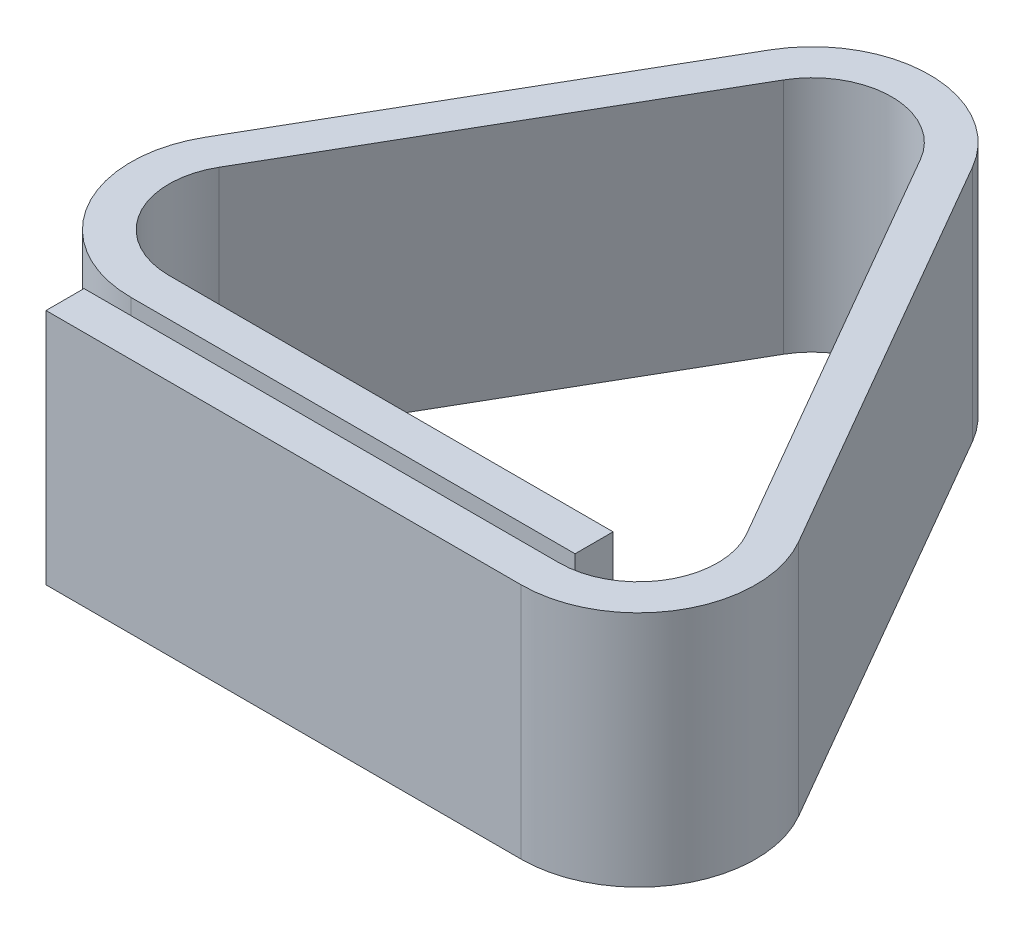
ISO-10303-21;
HEADER;
FILE_DESCRIPTION(('STEP AP214'),'2;1');
FILE_NAME('part.step','',(''),(''),'','','');
FILE_SCHEMA(('AUTOMOTIVE_DESIGN { 1 0 10303 214 1 1 1 1 }'));
ENDSEC;
DATA;
#1=APPLICATION_CONTEXT('core data for automotive mechanical design processes');
#2=APPLICATION_PROTOCOL_DEFINITION('international standard','automotive_design',2000,#1);
#3=PRODUCT_CONTEXT('',#1,'mechanical');
#4=PRODUCT('Part','Part','',(#3));
#5=PRODUCT_RELATED_PRODUCT_CATEGORY('part','',(#4));
#6=PRODUCT_DEFINITION_FORMATION('','',#4);
#7=PRODUCT_DEFINITION_CONTEXT('part definition',#1,'design');
#8=PRODUCT_DEFINITION('design','',#6,#7);
#9=PRODUCT_DEFINITION_SHAPE('','',#8);
#10=(LENGTH_UNIT() NAMED_UNIT(*) SI_UNIT(.MILLI.,.METRE.));
#11=(NAMED_UNIT(*) PLANE_ANGLE_UNIT() SI_UNIT($,.RADIAN.));
#12=(NAMED_UNIT(*) SI_UNIT($,.STERADIAN.) SOLID_ANGLE_UNIT());
#13=UNCERTAINTY_MEASURE_WITH_UNIT(LENGTH_MEASURE(1.E-05),#10,'distance_accuracy_value','');
#14=(GEOMETRIC_REPRESENTATION_CONTEXT(3) GLOBAL_UNCERTAINTY_ASSIGNED_CONTEXT((#13)) GLOBAL_UNIT_ASSIGNED_CONTEXT((#10,
#11,#12)) REPRESENTATION_CONTEXT('',''));
#15=CARTESIAN_POINT('',(0.,0.,0.));
#16=DIRECTION('',(0.,0.,1.));
#17=DIRECTION('',(1.,0.,0.));
#18=AXIS2_PLACEMENT_3D('',#15,#16,#17);
#19=CARTESIAN_POINT('',(0.,15.,0.));
#20=DIRECTION('',(1.,0.,0.));
#21=DIRECTION('',(0.,0.,-1.));
#22=AXIS2_PLACEMENT_3D('',#19,#20,#21);
#23=PLANE('',#22);
#24=DIRECTION('',(0.,0.,1.));
#25=VECTOR('',#24,1.);
#26=CARTESIAN_POINT('',(0.,0.,0.));
#27=LINE('',#26,#25);
#28=CARTESIAN_POINT('',(0.,0.,0.));
#29=VERTEX_POINT('',#28);
#30=CARTESIAN_POINT('',(0.,0.,2.4));
#31=VERTEX_POINT('',#30);
#32=EDGE_CURVE('E177',#29,#31,#27,.T.);
#33=ORIENTED_EDGE('',*,*,#32,.T.);
#34=DIRECTION('',(0.,-1.,0.));
#35=VECTOR('',#34,1.);
#36=CARTESIAN_POINT('',(0.,15.,2.4));
#37=LINE('',#36,#35);
#38=CARTESIAN_POINT('',(0.,15.,2.4));
#39=VERTEX_POINT('',#38);
#40=EDGE_CURVE('E11',#39,#31,#37,.T.);
#41=ORIENTED_EDGE('',*,*,#40,.F.);
#42=DIRECTION('',(0.,0.,1.));
#43=VECTOR('',#42,1.);
#44=CARTESIAN_POINT('',(0.,15.,0.));
#45=LINE('',#44,#43);
#46=CARTESIAN_POINT('',(0.,15.,0.));
#47=VERTEX_POINT('',#46);
#48=EDGE_CURVE('E207',#47,#39,#45,.T.);
#49=ORIENTED_EDGE('',*,*,#48,.F.);
#50=DIRECTION('',(0.,-1.,0.));
#51=VECTOR('',#50,1.);
#52=CARTESIAN_POINT('',(0.,15.,0.));
#53=LINE('',#52,#51);
#54=EDGE_CURVE('E173',#47,#29,#53,.T.);
#55=ORIENTED_EDGE('',*,*,#54,.T.);
#56=EDGE_LOOP('',(#33,#41,#49,#55));
#57=FACE_BOUND('',#56,.T.);
#58=ADVANCED_FACE('F33',(#57),#23,.F.);
#59=CARTESIAN_POINT('',(0.,15.,2.4));
#60=DIRECTION('',(0.,0.,-1.));
#61=DIRECTION('',(-1.,0.,0.));
#62=AXIS2_PLACEMENT_3D('',#59,#60,#61);
#63=PLANE('',#62);
#64=DIRECTION('',(1.,0.,0.));
#65=VECTOR('',#64,1.);
#66=CARTESIAN_POINT('',(0.,0.,2.4));
#67=LINE('',#66,#65);
#68=CARTESIAN_POINT('',(30.,0.,2.4));
#69=VERTEX_POINT('',#68);
#70=EDGE_CURVE('E180',#31,#69,#67,.T.);
#71=ORIENTED_EDGE('',*,*,#70,.T.);
#72=DIRECTION('',(0.,-1.,0.));
#73=VECTOR('',#72,1.);
#74=CARTESIAN_POINT('',(30.,15.,2.4));
#75=LINE('',#74,#73);
#76=CARTESIAN_POINT('',(30.,15.,2.4));
#77=VERTEX_POINT('',#76);
#78=EDGE_CURVE('E41',#77,#69,#75,.T.);
#79=ORIENTED_EDGE('',*,*,#78,.F.);
#80=DIRECTION('',(1.,0.,0.));
#81=VECTOR('',#80,1.);
#82=CARTESIAN_POINT('',(0.,15.,2.4));
#83=LINE('',#82,#81);
#84=EDGE_CURVE('E116',#39,#77,#83,.T.);
#85=ORIENTED_EDGE('',*,*,#84,.F.);
#86=ORIENTED_EDGE('',*,*,#40,.T.);
#87=EDGE_LOOP('',(#71,#79,#85,#86));
#88=FACE_BOUND('',#87,.T.);
#89=ADVANCED_FACE('F305',(#88),#63,.F.);
#90=CARTESIAN_POINT('',(30.,15.,-5.));
#91=DIRECTION('',(0.,-1.,0.));
#92=DIRECTION('',(0.,0.,-1.));
#93=AXIS2_PLACEMENT_3D('',#90,#91,#92);
#94=CYLINDRICAL_SURFACE('',#93,7.4);
#95=CARTESIAN_POINT('',(30.,0.,-5.));
#96=DIRECTION('',(0.,1.,0.));
#97=DIRECTION('',(0.,0.,1.));
#98=AXIS2_PLACEMENT_3D('',#95,#96,#97);
#99=CIRCLE('',#98,7.4);
#100=CARTESIAN_POINT('',(36.4085879880048,0.,-8.70000000000003));
#101=VERTEX_POINT('',#100);
#102=EDGE_CURVE('E182',#69,#101,#99,.T.);
#103=ORIENTED_EDGE('',*,*,#102,.T.);
#104=DIRECTION('',(0.,-1.,0.));
#105=VECTOR('',#104,1.);
#106=CARTESIAN_POINT('',(36.4085879880048,15.,-8.70000000000003));
#107=LINE('',#106,#105);
#108=CARTESIAN_POINT('',(36.4085879880048,15.,-8.70000000000003));
#109=VERTEX_POINT('',#108);
#110=EDGE_CURVE('E238',#109,#101,#107,.T.);
#111=ORIENTED_EDGE('',*,*,#110,.F.);
#112=CARTESIAN_POINT('',(30.,15.,-5.));
#113=DIRECTION('',(0.,1.,0.));
#114=DIRECTION('',(0.,0.,1.));
#115=AXIS2_PLACEMENT_3D('',#112,#113,#114);
#116=CIRCLE('',#115,7.4);
#117=EDGE_CURVE('E246',#77,#109,#116,.T.);
#118=ORIENTED_EDGE('',*,*,#117,.F.);
#119=ORIENTED_EDGE('',*,*,#78,.T.);
#120=EDGE_LOOP('',(#103,#111,#118,#119));
#121=FACE_BOUND('',#120,.T.);
#122=ADVANCED_FACE('F244',(#121),#94,.T.);
#123=CARTESIAN_POINT('',(36.4085879880048,15.,-8.70000000000003));
#124=DIRECTION('',(-0.866025403784436,0.,0.500000000000004));
#125=DIRECTION('',(0.500000000000004,0.,0.866025403784436));
#126=AXIS2_PLACEMENT_3D('',#123,#124,#125);
#127=PLANE('',#126);
#128=DIRECTION('',(-0.500000000000004,0.,-0.866025403784436));
#129=VECTOR('',#128,1.);
#130=CARTESIAN_POINT('',(36.4085879880048,0.,-8.70000000000003));
#131=LINE('',#130,#129);
#132=CARTESIAN_POINT('',(21.4085879880047,0.,-34.6807621135331));
#133=VERTEX_POINT('',#132);
#134=EDGE_CURVE('E184',#101,#133,#131,.T.);
#135=ORIENTED_EDGE('',*,*,#134,.T.);
#136=DIRECTION('',(0.,-1.,0.));
#137=VECTOR('',#136,1.);
#138=CARTESIAN_POINT('',(21.4085879880047,15.,-34.6807621135331));
#139=LINE('',#138,#137);
#140=CARTESIAN_POINT('',(21.4085879880047,15.,-34.6807621135331));
#141=VERTEX_POINT('',#140);
#142=EDGE_CURVE('E235',#141,#133,#139,.T.);
#143=ORIENTED_EDGE('',*,*,#142,.F.);
#144=DIRECTION('',(-0.500000000000004,0.,-0.866025403784436));
#145=VECTOR('',#144,1.);
#146=CARTESIAN_POINT('',(36.4085879880048,15.,-8.70000000000003));
#147=LINE('',#146,#145);
#148=EDGE_CURVE('E264',#109,#141,#147,.T.);
#149=ORIENTED_EDGE('',*,*,#148,.F.);
#150=ORIENTED_EDGE('',*,*,#110,.T.);
#151=EDGE_LOOP('',(#135,#143,#149,#150));
#152=FACE_BOUND('',#151,.T.);
#153=ADVANCED_FACE('F255',(#152),#127,.F.);
#154=CARTESIAN_POINT('',(14.9999999999999,15.,-30.9807621135331));
#155=DIRECTION('',(0.,-1.,0.));
#156=DIRECTION('',(0.,0.,-1.));
#157=AXIS2_PLACEMENT_3D('',#154,#155,#156);
#158=CYLINDRICAL_SURFACE('',#157,7.4);
#159=CARTESIAN_POINT('',(14.9999999999999,0.,-30.9807621135331));
#160=DIRECTION('',(0.,1.,0.));
#161=DIRECTION('',(0.,0.,1.));
#162=AXIS2_PLACEMENT_3D('',#159,#160,#161);
#163=CIRCLE('',#162,7.4);
#164=CARTESIAN_POINT('',(8.59141201199502,0.,-34.6807621135331));
#165=VERTEX_POINT('',#164);
#166=EDGE_CURVE('E186',#133,#165,#163,.T.);
#167=ORIENTED_EDGE('',*,*,#166,.T.);
#168=DIRECTION('',(0.,-1.,0.));
#169=VECTOR('',#168,1.);
#170=CARTESIAN_POINT('',(8.59141201199502,15.,-34.6807621135331));
#171=LINE('',#170,#169);
#172=CARTESIAN_POINT('',(8.59141201199502,15.,-34.6807621135331));
#173=VERTEX_POINT('',#172);
#174=EDGE_CURVE('E232',#173,#165,#171,.T.);
#175=ORIENTED_EDGE('',*,*,#174,.F.);
#176=CARTESIAN_POINT('',(14.9999999999999,15.,-30.9807621135331));
#177=DIRECTION('',(0.,1.,0.));
#178=DIRECTION('',(0.,0.,1.));
#179=AXIS2_PLACEMENT_3D('',#176,#177,#178);
#180=CIRCLE('',#179,7.4);
#181=EDGE_CURVE('E261',#141,#173,#180,.T.);
#182=ORIENTED_EDGE('',*,*,#181,.F.);
#183=ORIENTED_EDGE('',*,*,#142,.T.);
#184=EDGE_LOOP('',(#167,#175,#182,#183));
#185=FACE_BOUND('',#184,.T.);
#186=ADVANCED_FACE('F259',(#185),#158,.T.);
#187=CARTESIAN_POINT('',(8.59141201199502,15.,-34.6807621135331));
#188=DIRECTION('',(0.866025403784439,0.,0.5));
#189=DIRECTION('',(0.5,0.,-0.866025403784439));
#190=AXIS2_PLACEMENT_3D('',#187,#188,#189);
#191=PLANE('',#190);
#192=DIRECTION('',(-0.5,0.,0.866025403784439));
#193=VECTOR('',#192,1.);
#194=CARTESIAN_POINT('',(8.59141201199502,0.,-34.6807621135331));
#195=LINE('',#194,#193);
#196=CARTESIAN_POINT('',(-4.44559707276024,0.,-12.0999999999999));
#197=VERTEX_POINT('',#196);
#198=EDGE_CURVE('E188',#165,#197,#195,.T.);
#199=ORIENTED_EDGE('',*,*,#198,.T.);
#200=DIRECTION('',(0.,-1.,0.));
#201=VECTOR('',#200,1.);
#202=CARTESIAN_POINT('',(-4.44559707276024,15.,-12.0999999999999));
#203=LINE('',#202,#201);
#204=CARTESIAN_POINT('',(-4.44559707276024,15.,-12.0999999999999));
#205=VERTEX_POINT('',#204);
#206=EDGE_CURVE('E229',#205,#197,#203,.T.);
#207=ORIENTED_EDGE('',*,*,#206,.F.);
#208=DIRECTION('',(-0.5,0.,0.866025403784439));
#209=VECTOR('',#208,1.);
#210=CARTESIAN_POINT('',(8.59141201199502,15.,-34.6807621135331));
#211=LINE('',#210,#209);
#212=EDGE_CURVE('E263',#173,#205,#211,.T.);
#213=ORIENTED_EDGE('',*,*,#212,.F.);
#214=ORIENTED_EDGE('',*,*,#174,.T.);
#215=EDGE_LOOP('',(#199,#207,#213,#214));
#216=FACE_BOUND('',#215,.T.);
#217=ADVANCED_FACE('F318',(#216),#191,.F.);
#218=CARTESIAN_POINT('',(1.96299091524461,15.,-8.39999999999994));
#219=DIRECTION('',(0.,-1.,0.));
#220=DIRECTION('',(0.,0.,-1.));
#221=AXIS2_PLACEMENT_3D('',#218,#219,#220);
#222=CYLINDRICAL_SURFACE('',#221,7.4);
#223=CARTESIAN_POINT('',(1.96299091524461,0.,-8.39999999999994));
#224=DIRECTION('',(0.,1.,0.));
#225=DIRECTION('',(0.,0.,1.));
#226=AXIS2_PLACEMENT_3D('',#223,#224,#225);
#227=CIRCLE('',#226,7.4);
#228=CARTESIAN_POINT('',(1.96299091524462,0.,-0.999999999999942));
#229=VERTEX_POINT('',#228);
#230=EDGE_CURVE('E190',#197,#229,#227,.T.);
#231=ORIENTED_EDGE('',*,*,#230,.T.);
#232=DIRECTION('',(0.,-1.,0.));
#233=VECTOR('',#232,1.);
#234=CARTESIAN_POINT('',(1.96299091524462,15.,-0.999999999999942));
#235=LINE('',#234,#233);
#236=CARTESIAN_POINT('',(1.96299091524462,15.,-0.999999999999942));
#237=VERTEX_POINT('',#236);
#238=EDGE_CURVE('E226',#237,#229,#235,.T.);
#239=ORIENTED_EDGE('',*,*,#238,.F.);
#240=CARTESIAN_POINT('',(1.96299091524461,15.,-8.39999999999994));
#241=DIRECTION('',(0.,1.,0.));
#242=DIRECTION('',(0.,0.,1.));
#243=AXIS2_PLACEMENT_3D('',#240,#241,#242);
#244=CIRCLE('',#243,7.4);
#245=EDGE_CURVE('E266',#205,#237,#244,.T.);
#246=ORIENTED_EDGE('',*,*,#245,.F.);
#247=ORIENTED_EDGE('',*,*,#206,.T.);
#248=EDGE_LOOP('',(#231,#239,#246,#247));
#249=FACE_BOUND('',#248,.T.);
#250=ADVANCED_FACE('F321',(#249),#222,.T.);
#251=CARTESIAN_POINT('',(1.96299091524462,15.,-0.999999999999942));
#252=DIRECTION('',(0.,0.,-1.));
#253=DIRECTION('',(-1.,0.,0.));
#254=AXIS2_PLACEMENT_3D('',#251,#252,#253);
#255=PLANE('',#254);
#256=DIRECTION('',(1.,0.,0.));
#257=VECTOR('',#256,1.);
#258=CARTESIAN_POINT('',(1.96299091524462,0.,-0.999999999999942));
#259=LINE('',#258,#257);
#260=CARTESIAN_POINT('',(30.,0.,-1.));
#261=VERTEX_POINT('',#260);
#262=EDGE_CURVE('E192',#229,#261,#259,.T.);
#263=ORIENTED_EDGE('',*,*,#262,.T.);
#264=DIRECTION('',(0.,-1.,0.));
#265=VECTOR('',#264,1.);
#266=CARTESIAN_POINT('',(30.,15.,-1.));
#267=LINE('',#266,#265);
#268=CARTESIAN_POINT('',(30.,15.,-1.));
#269=VERTEX_POINT('',#268);
#270=EDGE_CURVE('E223',#269,#261,#267,.T.);
#271=ORIENTED_EDGE('',*,*,#270,.F.);
#272=DIRECTION('',(1.,0.,0.));
#273=VECTOR('',#272,1.);
#274=CARTESIAN_POINT('',(1.96299091524462,15.,-0.999999999999942));
#275=LINE('',#274,#273);
#276=EDGE_CURVE('E272',#237,#269,#275,.T.);
#277=ORIENTED_EDGE('',*,*,#276,.F.);
#278=ORIENTED_EDGE('',*,*,#238,.T.);
#279=EDGE_LOOP('',(#263,#271,#277,#278));
#280=FACE_BOUND('',#279,.T.);
#281=ADVANCED_FACE('F325',(#280),#255,.F.);
#282=CARTESIAN_POINT('',(30.,15.,-3.4));
#283=DIRECTION('',(-1.,0.,0.));
#284=DIRECTION('',(0.,0.,1.));
#285=AXIS2_PLACEMENT_3D('',#282,#283,#284);
#286=PLANE('',#285);
#287=DIRECTION('',(0.,0.,-1.));
#288=VECTOR('',#287,1.);
#289=CARTESIAN_POINT('',(30.,0.,-3.4));
#290=LINE('',#289,#288);
#291=CARTESIAN_POINT('',(30.,0.,-3.4));
#292=VERTEX_POINT('',#291);
#293=EDGE_CURVE('E194',#261,#292,#290,.T.);
#294=ORIENTED_EDGE('',*,*,#293,.T.);
#295=DIRECTION('',(0.,-1.,0.));
#296=VECTOR('',#295,1.);
#297=CARTESIAN_POINT('',(30.,15.,-3.4));
#298=LINE('',#297,#296);
#299=CARTESIAN_POINT('',(30.,15.,-3.4));
#300=VERTEX_POINT('',#299);
#301=EDGE_CURVE('E220',#300,#292,#298,.T.);
#302=ORIENTED_EDGE('',*,*,#301,.F.);
#303=DIRECTION('',(0.,0.,-1.));
#304=VECTOR('',#303,1.);
#305=CARTESIAN_POINT('',(30.,15.,-3.4));
#306=LINE('',#305,#304);
#307=EDGE_CURVE('E274',#269,#300,#306,.T.);
#308=ORIENTED_EDGE('',*,*,#307,.F.);
#309=ORIENTED_EDGE('',*,*,#270,.T.);
#310=EDGE_LOOP('',(#294,#302,#308,#309));
#311=FACE_BOUND('',#310,.T.);
#312=ADVANCED_FACE('F329',(#311),#286,.F.);
#313=CARTESIAN_POINT('',(1.96299091524462,15.,-3.39999999999994));
#314=DIRECTION('',(0.,0.,1.));
#315=DIRECTION('',(1.,0.,0.));
#316=AXIS2_PLACEMENT_3D('',#313,#314,#315);
#317=PLANE('',#316);
#318=DIRECTION('',(-1.,0.,0.));
#319=VECTOR('',#318,1.);
#320=CARTESIAN_POINT('',(1.96299091524462,0.,-3.39999999999994));
#321=LINE('',#320,#319);
#322=CARTESIAN_POINT('',(1.96299091524461,0.,-3.39999999999994));
#323=VERTEX_POINT('',#322);
#324=EDGE_CURVE('E196',#292,#323,#321,.T.);
#325=ORIENTED_EDGE('',*,*,#324,.T.);
#326=DIRECTION('',(0.,-1.,0.));
#327=VECTOR('',#326,1.);
#328=CARTESIAN_POINT('',(1.96299091524461,15.,-3.39999999999994));
#329=LINE('',#328,#327);
#330=CARTESIAN_POINT('',(1.96299091524461,15.,-3.39999999999994));
#331=VERTEX_POINT('',#330);
#332=EDGE_CURVE('E217',#331,#323,#329,.T.);
#333=ORIENTED_EDGE('',*,*,#332,.F.);
#334=DIRECTION('',(-1.,0.,0.));
#335=VECTOR('',#334,1.);
#336=CARTESIAN_POINT('',(1.96299091524462,15.,-3.39999999999994));
#337=LINE('',#336,#335);
#338=EDGE_CURVE('E276',#300,#331,#337,.T.);
#339=ORIENTED_EDGE('',*,*,#338,.F.);
#340=ORIENTED_EDGE('',*,*,#301,.T.);
#341=EDGE_LOOP('',(#325,#333,#339,#340));
#342=FACE_BOUND('',#341,.T.);
#343=ADVANCED_FACE('F333',(#342),#317,.F.);
#344=CARTESIAN_POINT('',(1.96299091524461,15.,-8.39999999999994));
#345=DIRECTION('',(0.,-1.,0.));
#346=DIRECTION('',(0.,0.,-1.));
#347=AXIS2_PLACEMENT_3D('',#344,#345,#346);
#348=CYLINDRICAL_SURFACE('',#347,5.);
#349=CARTESIAN_POINT('',(1.96299091524461,0.,-8.39999999999994));
#350=DIRECTION('',(0.,-1.,0.));
#351=DIRECTION('',(0.,0.,1.));
#352=AXIS2_PLACEMENT_3D('',#349,#350,#351);
#353=CIRCLE('',#352,5.);
#354=CARTESIAN_POINT('',(-2.36713610367758,0.,-10.8999999999999));
#355=VERTEX_POINT('',#354);
#356=EDGE_CURVE('E198',#323,#355,#353,.T.);
#357=ORIENTED_EDGE('',*,*,#356,.T.);
#358=DIRECTION('',(0.,-1.,0.));
#359=VECTOR('',#358,1.);
#360=CARTESIAN_POINT('',(-2.36713610367758,15.,-10.8999999999999));
#361=LINE('',#360,#359);
#362=CARTESIAN_POINT('',(-2.36713610367758,15.,-10.8999999999999));
#363=VERTEX_POINT('',#362);
#364=EDGE_CURVE('E214',#363,#355,#361,.T.);
#365=ORIENTED_EDGE('',*,*,#364,.F.);
#366=CARTESIAN_POINT('',(1.96299091524461,15.,-8.39999999999994));
#367=DIRECTION('',(0.,-1.,0.));
#368=DIRECTION('',(0.,0.,1.));
#369=AXIS2_PLACEMENT_3D('',#366,#367,#368);
#370=CIRCLE('',#369,5.);
#371=EDGE_CURVE('E278',#331,#363,#370,.T.);
#372=ORIENTED_EDGE('',*,*,#371,.F.);
#373=ORIENTED_EDGE('',*,*,#332,.T.);
#374=EDGE_LOOP('',(#357,#365,#372,#373));
#375=FACE_BOUND('',#374,.T.);
#376=ADVANCED_FACE('F337',(#375),#348,.F.);
#377=CARTESIAN_POINT('',(10.6698729810777,15.,-33.4807621135331));
#378=DIRECTION('',(-0.866025403784439,0.,-0.5));
#379=DIRECTION('',(-0.5,0.,0.866025403784439));
#380=AXIS2_PLACEMENT_3D('',#377,#378,#379);
#381=PLANE('',#380);
#382=DIRECTION('',(0.5,0.,-0.866025403784439));
#383=VECTOR('',#382,1.);
#384=CARTESIAN_POINT('',(10.6698729810777,0.,-33.4807621135331));
#385=LINE('',#384,#383);
#386=CARTESIAN_POINT('',(10.6698729810777,0.,-33.4807621135331));
#387=VERTEX_POINT('',#386);
#388=EDGE_CURVE('E200',#355,#387,#385,.T.);
#389=ORIENTED_EDGE('',*,*,#388,.T.);
#390=DIRECTION('',(0.,-1.,0.));
#391=VECTOR('',#390,1.);
#392=CARTESIAN_POINT('',(10.6698729810777,15.,-33.4807621135331));
#393=LINE('',#392,#391);
#394=CARTESIAN_POINT('',(10.6698729810777,15.,-33.4807621135331));
#395=VERTEX_POINT('',#394);
#396=EDGE_CURVE('E211',#395,#387,#393,.T.);
#397=ORIENTED_EDGE('',*,*,#396,.F.);
#398=DIRECTION('',(0.5,0.,-0.866025403784439));
#399=VECTOR('',#398,1.);
#400=CARTESIAN_POINT('',(10.6698729810777,15.,-33.4807621135331));
#401=LINE('',#400,#399);
#402=EDGE_CURVE('E280',#363,#395,#401,.T.);
#403=ORIENTED_EDGE('',*,*,#402,.F.);
#404=ORIENTED_EDGE('',*,*,#364,.T.);
#405=EDGE_LOOP('',(#389,#397,#403,#404));
#406=FACE_BOUND('',#405,.T.);
#407=ADVANCED_FACE('F286',(#406),#381,.F.);
#408=CARTESIAN_POINT('',(14.9999999999999,15.,-30.9807621135331));
#409=DIRECTION('',(0.,-1.,0.));
#410=DIRECTION('',(0.,0.,-1.));
#411=AXIS2_PLACEMENT_3D('',#408,#409,#410);
#412=CYLINDRICAL_SURFACE('',#411,5.);
#413=CARTESIAN_POINT('',(14.9999999999999,0.,-30.9807621135331));
#414=DIRECTION('',(0.,-1.,0.));
#415=DIRECTION('',(0.,0.,1.));
#416=AXIS2_PLACEMENT_3D('',#413,#414,#415);
#417=CIRCLE('',#416,5.);
#418=CARTESIAN_POINT('',(19.330127018922,0.,-33.4807621135331));
#419=VERTEX_POINT('',#418);
#420=EDGE_CURVE('E202',#387,#419,#417,.T.);
#421=ORIENTED_EDGE('',*,*,#420,.T.);
#422=DIRECTION('',(0.,-1.,0.));
#423=VECTOR('',#422,1.);
#424=CARTESIAN_POINT('',(19.330127018922,15.,-33.4807621135331));
#425=LINE('',#424,#423);
#426=CARTESIAN_POINT('',(19.330127018922,15.,-33.4807621135331));
#427=VERTEX_POINT('',#426);
#428=EDGE_CURVE('E168',#427,#419,#425,.T.);
#429=ORIENTED_EDGE('',*,*,#428,.F.);
#430=CARTESIAN_POINT('',(14.9999999999999,15.,-30.9807621135331));
#431=DIRECTION('',(0.,-1.,0.));
#432=DIRECTION('',(0.,0.,1.));
#433=AXIS2_PLACEMENT_3D('',#430,#431,#432);
#434=CIRCLE('',#433,5.);
#435=EDGE_CURVE('E159',#395,#427,#434,.T.);
#436=ORIENTED_EDGE('',*,*,#435,.F.);
#437=ORIENTED_EDGE('',*,*,#396,.T.);
#438=EDGE_LOOP('',(#421,#429,#436,#437));
#439=FACE_BOUND('',#438,.T.);
#440=ADVANCED_FACE('F290',(#439),#412,.F.);
#441=CARTESIAN_POINT('',(34.3301270189222,15.,-7.50000000000003));
#442=DIRECTION('',(0.866025403784436,0.,-0.500000000000005));
#443=DIRECTION('',(-0.500000000000005,0.,-0.866025403784436));
#444=AXIS2_PLACEMENT_3D('',#441,#442,#443);
#445=PLANE('',#444);
#446=DIRECTION('',(0.500000000000005,0.,0.866025403784436));
#447=VECTOR('',#446,1.);
#448=CARTESIAN_POINT('',(34.3301270189222,0.,-7.50000000000003));
#449=LINE('',#448,#447);
#450=CARTESIAN_POINT('',(34.3301270189222,0.,-7.50000000000002));
#451=VERTEX_POINT('',#450);
#452=EDGE_CURVE('E167',#419,#451,#449,.T.);
#453=ORIENTED_EDGE('',*,*,#452,.T.);
#454=DIRECTION('',(0.,-1.,0.));
#455=VECTOR('',#454,1.);
#456=CARTESIAN_POINT('',(34.3301270189222,15.,-7.50000000000002));
#457=LINE('',#456,#455);
#458=CARTESIAN_POINT('',(34.3301270189222,15.,-7.50000000000002));
#459=VERTEX_POINT('',#458);
#460=EDGE_CURVE('E164',#459,#451,#457,.T.);
#461=ORIENTED_EDGE('',*,*,#460,.F.);
#462=DIRECTION('',(0.500000000000005,0.,0.866025403784436));
#463=VECTOR('',#462,1.);
#464=CARTESIAN_POINT('',(34.3301270189222,15.,-7.50000000000003));
#465=LINE('',#464,#463);
#466=EDGE_CURVE('E153',#427,#459,#465,.T.);
#467=ORIENTED_EDGE('',*,*,#466,.F.);
#468=ORIENTED_EDGE('',*,*,#428,.T.);
#469=EDGE_LOOP('',(#453,#461,#467,#468));
#470=FACE_BOUND('',#469,.T.);
#471=ADVANCED_FACE('F165',(#470),#445,.F.);
#472=CARTESIAN_POINT('',(30.,15.,-5.));
#473=DIRECTION('',(0.,-1.,0.));
#474=DIRECTION('',(0.,0.,-1.));
#475=AXIS2_PLACEMENT_3D('',#472,#473,#474);
#476=CYLINDRICAL_SURFACE('',#475,5.00000000000001);
#477=CARTESIAN_POINT('',(30.,0.,-5.));
#478=DIRECTION('',(0.,-1.,0.));
#479=DIRECTION('',(0.,0.,1.));
#480=AXIS2_PLACEMENT_3D('',#477,#478,#479);
#481=CIRCLE('',#480,5.00000000000001);
#482=CARTESIAN_POINT('',(30.,0.,0.));
#483=VERTEX_POINT('',#482);
#484=EDGE_CURVE('E102',#451,#483,#481,.T.);
#485=ORIENTED_EDGE('',*,*,#484,.T.);
#486=DIRECTION('',(0.,-1.,0.));
#487=VECTOR('',#486,1.);
#488=CARTESIAN_POINT('',(30.,15.,0.));
#489=LINE('',#488,#487);
#490=CARTESIAN_POINT('',(30.,15.,0.));
#491=VERTEX_POINT('',#490);
#492=EDGE_CURVE('E169',#491,#483,#489,.T.);
#493=ORIENTED_EDGE('',*,*,#492,.F.);
#494=CARTESIAN_POINT('',(30.,15.,-5.));
#495=DIRECTION('',(0.,-1.,0.));
#496=DIRECTION('',(0.,0.,1.));
#497=AXIS2_PLACEMENT_3D('',#494,#495,#496);
#498=CIRCLE('',#497,5.00000000000001);
#499=EDGE_CURVE('E157',#459,#491,#498,.T.);
#500=ORIENTED_EDGE('',*,*,#499,.F.);
#501=ORIENTED_EDGE('',*,*,#460,.T.);
#502=EDGE_LOOP('',(#485,#493,#500,#501));
#503=FACE_BOUND('',#502,.T.);
#504=ADVANCED_FACE('F171',(#503),#476,.F.);
#505=CARTESIAN_POINT('',(0.,15.,0.));
#506=DIRECTION('',(0.,0.,1.));
#507=DIRECTION('',(1.,0.,0.));
#508=AXIS2_PLACEMENT_3D('',#505,#506,#507);
#509=PLANE('',#508);
#510=DIRECTION('',(-1.,0.,0.));
#511=VECTOR('',#510,1.);
#512=CARTESIAN_POINT('',(0.,0.,0.));
#513=LINE('',#512,#511);
#514=EDGE_CURVE('E108',#483,#29,#513,.T.);
#515=ORIENTED_EDGE('',*,*,#514,.T.);
#516=ORIENTED_EDGE('',*,*,#54,.F.);
#517=DIRECTION('',(-1.,0.,0.));
#518=VECTOR('',#517,1.);
#519=CARTESIAN_POINT('',(0.,15.,0.));
#520=LINE('',#519,#518);
#521=EDGE_CURVE('E49',#491,#47,#520,.T.);
#522=ORIENTED_EDGE('',*,*,#521,.F.);
#523=ORIENTED_EDGE('',*,*,#492,.T.);
#524=EDGE_LOOP('',(#515,#516,#522,#523));
#525=FACE_BOUND('',#524,.T.);
#526=ADVANCED_FACE('F294',(#525),#509,.F.);
#527=CARTESIAN_POINT('',(30.,15.,-5.));
#528=DIRECTION('',(0.,1.,0.));
#529=DIRECTION('',(0.,0.,1.));
#530=AXIS2_PLACEMENT_3D('',#527,#528,#529);
#531=PLANE('',#530);
#532=ORIENTED_EDGE('',*,*,#48,.T.);
#533=ORIENTED_EDGE('',*,*,#84,.T.);
#534=ORIENTED_EDGE('',*,*,#117,.T.);
#535=ORIENTED_EDGE('',*,*,#148,.T.);
#536=ORIENTED_EDGE('',*,*,#181,.T.);
#537=ORIENTED_EDGE('',*,*,#212,.T.);
#538=ORIENTED_EDGE('',*,*,#245,.T.);
#539=ORIENTED_EDGE('',*,*,#276,.T.);
#540=ORIENTED_EDGE('',*,*,#307,.T.);
#541=ORIENTED_EDGE('',*,*,#338,.T.);
#542=ORIENTED_EDGE('',*,*,#371,.T.);
#543=ORIENTED_EDGE('',*,*,#402,.T.);
#544=ORIENTED_EDGE('',*,*,#435,.T.);
#545=ORIENTED_EDGE('',*,*,#466,.T.);
#546=ORIENTED_EDGE('',*,*,#499,.T.);
#547=ORIENTED_EDGE('',*,*,#521,.T.);
#548=EDGE_LOOP('',(#532,#533,#534,#535,#536,#537,#538,#539,#540,#541,#542,#543,#544,#545,#546,#547));
#549=FACE_BOUND('',#548,.T.);
#550=ADVANCED_FACE('F155',(#549),#531,.T.);
#551=CARTESIAN_POINT('',(30.,0.,-5.));
#552=DIRECTION('',(0.,1.,0.));
#553=DIRECTION('',(0.,0.,1.));
#554=AXIS2_PLACEMENT_3D('',#551,#552,#553);
#555=PLANE('',#554);
#556=ORIENTED_EDGE('',*,*,#32,.F.);
#557=ORIENTED_EDGE('',*,*,#514,.F.);
#558=ORIENTED_EDGE('',*,*,#484,.F.);
#559=ORIENTED_EDGE('',*,*,#452,.F.);
#560=ORIENTED_EDGE('',*,*,#420,.F.);
#561=ORIENTED_EDGE('',*,*,#388,.F.);
#562=ORIENTED_EDGE('',*,*,#356,.F.);
#563=ORIENTED_EDGE('',*,*,#324,.F.);
#564=ORIENTED_EDGE('',*,*,#293,.F.);
#565=ORIENTED_EDGE('',*,*,#262,.F.);
#566=ORIENTED_EDGE('',*,*,#230,.F.);
#567=ORIENTED_EDGE('',*,*,#198,.F.);
#568=ORIENTED_EDGE('',*,*,#166,.F.);
#569=ORIENTED_EDGE('',*,*,#134,.F.);
#570=ORIENTED_EDGE('',*,*,#102,.F.);
#571=ORIENTED_EDGE('',*,*,#70,.F.);
#572=EDGE_LOOP('',(#556,#557,#558,#559,#560,#561,#562,#563,#564,#565,#566,#567,#568,#569,#570,#571));
#573=FACE_BOUND('',#572,.T.);
#574=ADVANCED_FACE('F250',(#573),#555,.F.);
#575=CLOSED_SHELL('',(#58,#89,#122,#153,#186,#217,#250,#281,#312,#343,#376,#407,#440,#471,#504,
#526,#550,#574));
#576=MANIFOLD_SOLID_BREP('B2',#575);
#577=ADVANCED_BREP_SHAPE_REPRESENTATION('',(#18,#576),#14);
#578=SHAPE_DEFINITION_REPRESENTATION(#9,#577);
ENDSEC;
END-ISO-10303-21;
